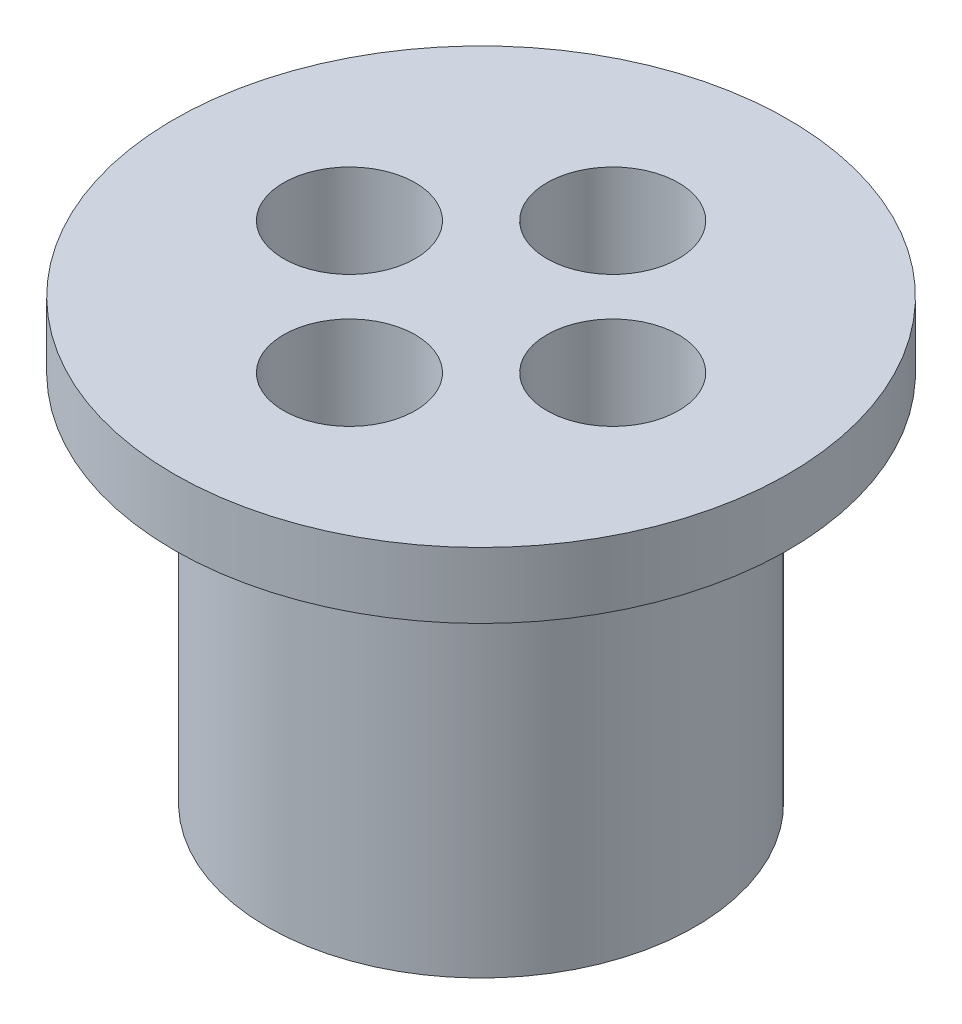
ISO-10303-21;
HEADER;
FILE_DESCRIPTION(('STEP AP214'),'2;1');
FILE_NAME('part.step','',(''),(''),'','','');
FILE_SCHEMA(('AUTOMOTIVE_DESIGN { 1 0 10303 214 1 1 1 1 }'));
ENDSEC;
DATA;
#1=APPLICATION_CONTEXT('core data for automotive mechanical design processes');
#2=APPLICATION_PROTOCOL_DEFINITION('international standard','automotive_design',2000,#1);
#3=PRODUCT_CONTEXT('',#1,'mechanical');
#4=PRODUCT('Part','Part','',(#3));
#5=PRODUCT_RELATED_PRODUCT_CATEGORY('part','',(#4));
#6=PRODUCT_DEFINITION_FORMATION('','',#4);
#7=PRODUCT_DEFINITION_CONTEXT('part definition',#1,'design');
#8=PRODUCT_DEFINITION('design','',#6,#7);
#9=PRODUCT_DEFINITION_SHAPE('','',#8);
#10=(LENGTH_UNIT() NAMED_UNIT(*) SI_UNIT(.MILLI.,.METRE.));
#11=(NAMED_UNIT(*) PLANE_ANGLE_UNIT() SI_UNIT($,.RADIAN.));
#12=(NAMED_UNIT(*) SI_UNIT($,.STERADIAN.) SOLID_ANGLE_UNIT());
#13=UNCERTAINTY_MEASURE_WITH_UNIT(LENGTH_MEASURE(1.E-05),#10,'distance_accuracy_value','');
#14=(GEOMETRIC_REPRESENTATION_CONTEXT(3) GLOBAL_UNCERTAINTY_ASSIGNED_CONTEXT((#13)) GLOBAL_UNIT_ASSIGNED_CONTEXT((#10,
#11,#12)) REPRESENTATION_CONTEXT('',''));
#15=CARTESIAN_POINT('',(0.,0.,0.));
#16=DIRECTION('',(0.,0.,1.));
#17=DIRECTION('',(1.,0.,0.));
#18=AXIS2_PLACEMENT_3D('',#15,#16,#17);
#19=CARTESIAN_POINT('',(0.,20.,6.));
#20=DIRECTION('',(0.,-1.,0.));
#21=DIRECTION('',(0.,0.,-1.));
#22=AXIS2_PLACEMENT_3D('',#19,#20,#21);
#23=CYLINDRICAL_SURFACE('',#22,1.75);
#24=CARTESIAN_POINT('',(0.,0.,6.));
#25=DIRECTION('',(0.,-1.,0.));
#26=DIRECTION('',(0.,0.,-1.));
#27=AXIS2_PLACEMENT_3D('',#24,#25,#26);
#28=CIRCLE('',#27,1.75);
#29=CARTESIAN_POINT('',(0.,0.,4.25));
#30=VERTEX_POINT('',#29);
#31=EDGE_CURVE('E95',#30,#30,#28,.T.);
#32=ORIENTED_EDGE('',*,*,#31,.T.);
#33=EDGE_LOOP('',(#32));
#34=FACE_BOUND('',#33,.T.);
#35=CARTESIAN_POINT('',(0.,10.,6.));
#36=DIRECTION('',(0.,1.,0.));
#37=DIRECTION('',(0.,0.,1.));
#38=AXIS2_PLACEMENT_3D('',#35,#36,#37);
#39=CIRCLE('',#38,1.75);
#40=CARTESIAN_POINT('',(0.,10.,7.75));
#41=VERTEX_POINT('',#40);
#42=EDGE_CURVE('E44',#41,#41,#39,.F.);
#43=ORIENTED_EDGE('',*,*,#42,.F.);
#44=EDGE_LOOP('',(#43));
#45=FACE_BOUND('',#44,.T.);
#46=ADVANCED_FACE('F40',(#34,#45),#23,.F.);
#47=CARTESIAN_POINT('',(-6.,20.,0.));
#48=DIRECTION('',(0.,-1.,0.));
#49=DIRECTION('',(0.,0.,-1.));
#50=AXIS2_PLACEMENT_3D('',#47,#48,#49);
#51=CYLINDRICAL_SURFACE('',#50,1.75);
#52=CARTESIAN_POINT('',(-6.,0.,0.));
#53=DIRECTION('',(0.,-1.,0.));
#54=DIRECTION('',(1.,0.,0.));
#55=AXIS2_PLACEMENT_3D('',#52,#53,#54);
#56=CIRCLE('',#55,1.75);
#57=CARTESIAN_POINT('',(-4.25,0.,0.));
#58=VERTEX_POINT('',#57);
#59=EDGE_CURVE('E65',#58,#58,#56,.T.);
#60=ORIENTED_EDGE('',*,*,#59,.T.);
#61=EDGE_LOOP('',(#60));
#62=FACE_BOUND('',#61,.T.);
#63=CARTESIAN_POINT('',(-6.,10.,0.));
#64=DIRECTION('',(0.,1.,0.));
#65=DIRECTION('',(0.,0.,1.));
#66=AXIS2_PLACEMENT_3D('',#63,#64,#65);
#67=CIRCLE('',#66,1.75);
#68=CARTESIAN_POINT('',(-6.,10.,1.75000000000006));
#69=VERTEX_POINT('',#68);
#70=EDGE_CURVE('E70',#69,#69,#67,.F.);
#71=ORIENTED_EDGE('',*,*,#70,.F.);
#72=EDGE_LOOP('',(#71));
#73=FACE_BOUND('',#72,.T.);
#74=ADVANCED_FACE('F131',(#62,#73),#51,.F.);
#75=CARTESIAN_POINT('',(6.,20.,0.));
#76=DIRECTION('',(0.,-1.,0.));
#77=DIRECTION('',(0.,0.,-1.));
#78=AXIS2_PLACEMENT_3D('',#75,#76,#77);
#79=CYLINDRICAL_SURFACE('',#78,1.75);
#80=CARTESIAN_POINT('',(6.,0.,0.));
#81=DIRECTION('',(0.,-1.,0.));
#82=DIRECTION('',(-1.,0.,0.));
#83=AXIS2_PLACEMENT_3D('',#80,#81,#82);
#84=CIRCLE('',#83,1.75);
#85=CARTESIAN_POINT('',(4.25,0.,0.));
#86=VERTEX_POINT('',#85);
#87=EDGE_CURVE('E91',#86,#86,#84,.T.);
#88=ORIENTED_EDGE('',*,*,#87,.T.);
#89=EDGE_LOOP('',(#88));
#90=FACE_BOUND('',#89,.T.);
#91=CARTESIAN_POINT('',(6.,10.,0.));
#92=DIRECTION('',(0.,1.,0.));
#93=DIRECTION('',(0.,0.,1.));
#94=AXIS2_PLACEMENT_3D('',#91,#92,#93);
#95=CIRCLE('',#94,1.75);
#96=CARTESIAN_POINT('',(6.,10.,1.74999999999998));
#97=VERTEX_POINT('',#96);
#98=EDGE_CURVE('E67',#97,#97,#95,.F.);
#99=ORIENTED_EDGE('',*,*,#98,.F.);
#100=EDGE_LOOP('',(#99));
#101=FACE_BOUND('',#100,.T.);
#102=ADVANCED_FACE('F137',(#90,#101),#79,.F.);
#103=CARTESIAN_POINT('',(0.,20.,-6.));
#104=DIRECTION('',(0.,-1.,0.));
#105=DIRECTION('',(0.,0.,-1.));
#106=AXIS2_PLACEMENT_3D('',#103,#104,#105);
#107=CYLINDRICAL_SURFACE('',#106,1.75);
#108=CARTESIAN_POINT('',(0.,0.,-6.));
#109=DIRECTION('',(0.,-1.,0.));
#110=DIRECTION('',(0.,0.,1.));
#111=AXIS2_PLACEMENT_3D('',#108,#109,#110);
#112=CIRCLE('',#111,1.75);
#113=CARTESIAN_POINT('',(0.,0.,-4.25));
#114=VERTEX_POINT('',#113);
#115=EDGE_CURVE('E96',#114,#114,#112,.T.);
#116=ORIENTED_EDGE('',*,*,#115,.T.);
#117=EDGE_LOOP('',(#116));
#118=FACE_BOUND('',#117,.T.);
#119=CARTESIAN_POINT('',(0.,10.,-6.));
#120=DIRECTION('',(0.,1.,0.));
#121=DIRECTION('',(0.,0.,1.));
#122=AXIS2_PLACEMENT_3D('',#119,#120,#121);
#123=CIRCLE('',#122,1.75);
#124=CARTESIAN_POINT('',(0.,10.,-4.25));
#125=VERTEX_POINT('',#124);
#126=EDGE_CURVE('E61',#125,#125,#123,.F.);
#127=ORIENTED_EDGE('',*,*,#126,.F.);
#128=EDGE_LOOP('',(#127));
#129=FACE_BOUND('',#128,.T.);
#130=ADVANCED_FACE('F142',(#118,#129),#107,.F.);
#131=CARTESIAN_POINT('',(0.,17.,0.));
#132=DIRECTION('',(0.,-1.,0.));
#133=DIRECTION('',(0.,0.,-1.));
#134=AXIS2_PLACEMENT_3D('',#131,#132,#133);
#135=CYLINDRICAL_SURFACE('',#134,9.75);
#136=CARTESIAN_POINT('',(0.,17.,0.));
#137=DIRECTION('',(0.,1.,0.));
#138=DIRECTION('',(0.,0.,1.));
#139=AXIS2_PLACEMENT_3D('',#136,#137,#138);
#140=CIRCLE('',#139,9.75);
#141=CARTESIAN_POINT('',(0.,17.,9.75));
#142=VERTEX_POINT('',#141);
#143=EDGE_CURVE('E10',#142,#142,#140,.T.);
#144=ORIENTED_EDGE('',*,*,#143,.F.);
#145=EDGE_LOOP('',(#144));
#146=FACE_BOUND('',#145,.T.);
#147=CARTESIAN_POINT('',(0.,0.,0.));
#148=DIRECTION('',(0.,1.,0.));
#149=DIRECTION('',(0.,0.,1.));
#150=AXIS2_PLACEMENT_3D('',#147,#148,#149);
#151=CIRCLE('',#150,9.75);
#152=CARTESIAN_POINT('',(0.,0.,9.75));
#153=VERTEX_POINT('',#152);
#154=EDGE_CURVE('E49',#153,#153,#151,.T.);
#155=ORIENTED_EDGE('',*,*,#154,.T.);
#156=EDGE_LOOP('',(#155));
#157=FACE_BOUND('',#156,.T.);
#158=ADVANCED_FACE('F42',(#146,#157),#135,.T.);
#159=CARTESIAN_POINT('',(0.,0.,0.));
#160=DIRECTION('',(0.,1.,0.));
#161=DIRECTION('',(0.,0.,1.));
#162=AXIS2_PLACEMENT_3D('',#159,#160,#161);
#163=PLANE('',#162);
#164=ORIENTED_EDGE('',*,*,#87,.F.);
#165=EDGE_LOOP('',(#164));
#166=FACE_BOUND('',#165,.T.);
#167=ORIENTED_EDGE('',*,*,#115,.F.);
#168=EDGE_LOOP('',(#167));
#169=FACE_BOUND('',#168,.T.);
#170=ORIENTED_EDGE('',*,*,#59,.F.);
#171=EDGE_LOOP('',(#170));
#172=FACE_BOUND('',#171,.T.);
#173=ORIENTED_EDGE('',*,*,#31,.F.);
#174=EDGE_LOOP('',(#173));
#175=FACE_BOUND('',#174,.T.);
#176=ORIENTED_EDGE('',*,*,#154,.F.);
#177=EDGE_LOOP('',(#176));
#178=FACE_BOUND('',#177,.T.);
#179=ADVANCED_FACE('F319',(#166,#169,#172,#175,#178),#163,.F.);
#180=CARTESIAN_POINT('',(0.,20.,0.));
#181=DIRECTION('',(0.,-1.,0.));
#182=DIRECTION('',(0.,0.,-1.));
#183=AXIS2_PLACEMENT_3D('',#180,#181,#182);
#184=CYLINDRICAL_SURFACE('',#183,14.);
#185=CARTESIAN_POINT('',(0.,20.,0.));
#186=DIRECTION('',(0.,1.,0.));
#187=DIRECTION('',(0.,0.,1.));
#188=AXIS2_PLACEMENT_3D('',#185,#186,#187);
#189=CIRCLE('',#188,14.);
#190=CARTESIAN_POINT('',(0.,20.,14.));
#191=VERTEX_POINT('',#190);
#192=EDGE_CURVE('E55',#191,#191,#189,.T.);
#193=ORIENTED_EDGE('',*,*,#192,.F.);
#194=EDGE_LOOP('',(#193));
#195=FACE_BOUND('',#194,.T.);
#196=CARTESIAN_POINT('',(0.,17.,0.));
#197=DIRECTION('',(0.,1.,0.));
#198=DIRECTION('',(0.,0.,1.));
#199=AXIS2_PLACEMENT_3D('',#196,#197,#198);
#200=CIRCLE('',#199,14.);
#201=CARTESIAN_POINT('',(0.,17.,14.));
#202=VERTEX_POINT('',#201);
#203=EDGE_CURVE('E58',#202,#202,#200,.T.);
#204=ORIENTED_EDGE('',*,*,#203,.T.);
#205=EDGE_LOOP('',(#204));
#206=FACE_BOUND('',#205,.T.);
#207=ADVANCED_FACE('F113',(#195,#206),#184,.T.);
#208=CARTESIAN_POINT('',(0.,20.,0.));
#209=DIRECTION('',(0.,1.,0.));
#210=DIRECTION('',(0.,0.,1.));
#211=AXIS2_PLACEMENT_3D('',#208,#209,#210);
#212=PLANE('',#211);
#213=CARTESIAN_POINT('',(0.,20.,6.));
#214=DIRECTION('',(0.,1.,0.));
#215=DIRECTION('',(0.,0.,-1.));
#216=AXIS2_PLACEMENT_3D('',#213,#214,#215);
#217=CIRCLE('',#216,3.);
#218=CARTESIAN_POINT('',(0.,20.,3.));
#219=VERTEX_POINT('',#218);
#220=EDGE_CURVE('E184',#219,#219,#217,.T.);
#221=ORIENTED_EDGE('',*,*,#220,.F.);
#222=EDGE_LOOP('',(#221));
#223=FACE_BOUND('',#222,.T.);
#224=CARTESIAN_POINT('',(6.,20.,0.));
#225=DIRECTION('',(0.,1.,0.));
#226=DIRECTION('',(-1.,0.,0.));
#227=AXIS2_PLACEMENT_3D('',#224,#225,#226);
#228=CIRCLE('',#227,3.);
#229=CARTESIAN_POINT('',(3.,20.,0.));
#230=VERTEX_POINT('',#229);
#231=EDGE_CURVE('E185',#230,#230,#228,.T.);
#232=ORIENTED_EDGE('',*,*,#231,.F.);
#233=EDGE_LOOP('',(#232));
#234=FACE_BOUND('',#233,.T.);
#235=CARTESIAN_POINT('',(-6.,20.,0.));
#236=DIRECTION('',(0.,1.,0.));
#237=DIRECTION('',(1.,0.,0.));
#238=AXIS2_PLACEMENT_3D('',#235,#236,#237);
#239=CIRCLE('',#238,3.);
#240=CARTESIAN_POINT('',(-3.,20.,0.));
#241=VERTEX_POINT('',#240);
#242=EDGE_CURVE('E197',#241,#241,#239,.T.);
#243=ORIENTED_EDGE('',*,*,#242,.F.);
#244=EDGE_LOOP('',(#243));
#245=FACE_BOUND('',#244,.T.);
#246=CARTESIAN_POINT('',(0.,20.,-6.));
#247=DIRECTION('',(0.,1.,0.));
#248=DIRECTION('',(0.,0.,1.));
#249=AXIS2_PLACEMENT_3D('',#246,#247,#248);
#250=CIRCLE('',#249,3.);
#251=CARTESIAN_POINT('',(0.,20.,-3.));
#252=VERTEX_POINT('',#251);
#253=EDGE_CURVE('E78',#252,#252,#250,.T.);
#254=ORIENTED_EDGE('',*,*,#253,.F.);
#255=EDGE_LOOP('',(#254));
#256=FACE_BOUND('',#255,.T.);
#257=ORIENTED_EDGE('',*,*,#192,.T.);
#258=EDGE_LOOP('',(#257));
#259=FACE_BOUND('',#258,.T.);
#260=ADVANCED_FACE('F118',(#223,#234,#245,#256,#259),#212,.T.);
#261=CARTESIAN_POINT('',(0.,17.,0.));
#262=DIRECTION('',(0.,1.,0.));
#263=DIRECTION('',(0.,0.,1.));
#264=AXIS2_PLACEMENT_3D('',#261,#262,#263);
#265=PLANE('',#264);
#266=ORIENTED_EDGE('',*,*,#143,.T.);
#267=EDGE_LOOP('',(#266));
#268=FACE_BOUND('',#267,.T.);
#269=ORIENTED_EDGE('',*,*,#203,.F.);
#270=EDGE_LOOP('',(#269));
#271=FACE_BOUND('',#270,.T.);
#272=ADVANCED_FACE('F115',(#268,#271),#265,.F.);
#273=CARTESIAN_POINT('',(0.,10.,-6.));
#274=DIRECTION('',(0.,1.,0.));
#275=DIRECTION('',(0.,0.,1.));
#276=AXIS2_PLACEMENT_3D('',#273,#274,#275);
#277=PLANE('',#276);
#278=CARTESIAN_POINT('',(0.,10.,-6.));
#279=DIRECTION('',(0.,1.,0.));
#280=DIRECTION('',(0.,0.,1.));
#281=AXIS2_PLACEMENT_3D('',#278,#279,#280);
#282=CIRCLE('',#281,3.);
#283=CARTESIAN_POINT('',(0.,10.,-3.));
#284=VERTEX_POINT('',#283);
#285=EDGE_CURVE('E66',#284,#284,#282,.T.);
#286=ORIENTED_EDGE('',*,*,#285,.T.);
#287=EDGE_LOOP('',(#286));
#288=FACE_BOUND('',#287,.T.);
#289=ORIENTED_EDGE('',*,*,#126,.T.);
#290=EDGE_LOOP('',(#289));
#291=FACE_BOUND('',#290,.T.);
#292=ADVANCED_FACE('F117',(#288,#291),#277,.T.);
#293=CARTESIAN_POINT('',(0.,10.,-6.));
#294=DIRECTION('',(0.,1.,0.));
#295=DIRECTION('',(0.,0.,1.));
#296=AXIS2_PLACEMENT_3D('',#293,#294,#295);
#297=CYLINDRICAL_SURFACE('',#296,3.);
#298=ORIENTED_EDGE('',*,*,#285,.F.);
#299=EDGE_LOOP('',(#298));
#300=FACE_BOUND('',#299,.T.);
#301=ORIENTED_EDGE('',*,*,#253,.T.);
#302=EDGE_LOOP('',(#301));
#303=FACE_BOUND('',#302,.T.);
#304=ADVANCED_FACE('F124',(#300,#303),#297,.F.);
#305=CARTESIAN_POINT('',(6.,10.,0.));
#306=DIRECTION('',(0.,1.,0.));
#307=DIRECTION('',(-1.,0.,0.));
#308=AXIS2_PLACEMENT_3D('',#305,#306,#307);
#309=PLANE('',#308);
#310=CARTESIAN_POINT('',(6.,10.,0.));
#311=DIRECTION('',(0.,1.,0.));
#312=DIRECTION('',(-1.,0.,0.));
#313=AXIS2_PLACEMENT_3D('',#310,#311,#312);
#314=CIRCLE('',#313,3.);
#315=CARTESIAN_POINT('',(3.,10.,0.));
#316=VERTEX_POINT('',#315);
#317=EDGE_CURVE('E180',#316,#316,#314,.T.);
#318=ORIENTED_EDGE('',*,*,#317,.T.);
#319=EDGE_LOOP('',(#318));
#320=FACE_BOUND('',#319,.T.);
#321=ORIENTED_EDGE('',*,*,#98,.T.);
#322=EDGE_LOOP('',(#321));
#323=FACE_BOUND('',#322,.T.);
#324=ADVANCED_FACE('F150',(#320,#323),#309,.T.);
#325=CARTESIAN_POINT('',(6.,10.,0.));
#326=DIRECTION('',(0.,1.,0.));
#327=DIRECTION('',(0.,0.,1.));
#328=AXIS2_PLACEMENT_3D('',#325,#326,#327);
#329=CYLINDRICAL_SURFACE('',#328,3.);
#330=ORIENTED_EDGE('',*,*,#317,.F.);
#331=EDGE_LOOP('',(#330));
#332=FACE_BOUND('',#331,.T.);
#333=ORIENTED_EDGE('',*,*,#231,.T.);
#334=EDGE_LOOP('',(#333));
#335=FACE_BOUND('',#334,.T.);
#336=ADVANCED_FACE('F161',(#332,#335),#329,.F.);
#337=CARTESIAN_POINT('',(-6.,10.,0.));
#338=DIRECTION('',(0.,1.,0.));
#339=DIRECTION('',(1.,0.,0.));
#340=AXIS2_PLACEMENT_3D('',#337,#338,#339);
#341=PLANE('',#340);
#342=CARTESIAN_POINT('',(-6.,10.,0.));
#343=DIRECTION('',(0.,1.,0.));
#344=DIRECTION('',(1.,0.,0.));
#345=AXIS2_PLACEMENT_3D('',#342,#343,#344);
#346=CIRCLE('',#345,3.);
#347=CARTESIAN_POINT('',(-3.,10.,0.));
#348=VERTEX_POINT('',#347);
#349=EDGE_CURVE('E71',#348,#348,#346,.T.);
#350=ORIENTED_EDGE('',*,*,#349,.T.);
#351=EDGE_LOOP('',(#350));
#352=FACE_BOUND('',#351,.T.);
#353=ORIENTED_EDGE('',*,*,#70,.T.);
#354=EDGE_LOOP('',(#353));
#355=FACE_BOUND('',#354,.T.);
#356=ADVANCED_FACE('F157',(#352,#355),#341,.T.);
#357=CARTESIAN_POINT('',(-6.,10.,0.));
#358=DIRECTION('',(0.,1.,0.));
#359=DIRECTION('',(0.,0.,1.));
#360=AXIS2_PLACEMENT_3D('',#357,#358,#359);
#361=CYLINDRICAL_SURFACE('',#360,3.);
#362=ORIENTED_EDGE('',*,*,#349,.F.);
#363=EDGE_LOOP('',(#362));
#364=FACE_BOUND('',#363,.T.);
#365=ORIENTED_EDGE('',*,*,#242,.T.);
#366=EDGE_LOOP('',(#365));
#367=FACE_BOUND('',#366,.T.);
#368=ADVANCED_FACE('F153',(#364,#367),#361,.F.);
#369=CARTESIAN_POINT('',(0.,10.,6.));
#370=DIRECTION('',(0.,1.,0.));
#371=DIRECTION('',(0.,0.,-1.));
#372=AXIS2_PLACEMENT_3D('',#369,#370,#371);
#373=PLANE('',#372);
#374=CARTESIAN_POINT('',(0.,10.,6.));
#375=DIRECTION('',(0.,1.,0.));
#376=DIRECTION('',(0.,0.,-1.));
#377=AXIS2_PLACEMENT_3D('',#374,#375,#376);
#378=CIRCLE('',#377,3.);
#379=CARTESIAN_POINT('',(0.,10.,3.));
#380=VERTEX_POINT('',#379);
#381=EDGE_CURVE('E190',#380,#380,#378,.T.);
#382=ORIENTED_EDGE('',*,*,#381,.T.);
#383=EDGE_LOOP('',(#382));
#384=FACE_BOUND('',#383,.T.);
#385=ORIENTED_EDGE('',*,*,#42,.T.);
#386=EDGE_LOOP('',(#385));
#387=FACE_BOUND('',#386,.T.);
#388=ADVANCED_FACE('F156',(#384,#387),#373,.T.);
#389=CARTESIAN_POINT('',(0.,10.,6.));
#390=DIRECTION('',(0.,1.,0.));
#391=DIRECTION('',(0.,0.,1.));
#392=AXIS2_PLACEMENT_3D('',#389,#390,#391);
#393=CYLINDRICAL_SURFACE('',#392,3.);
#394=ORIENTED_EDGE('',*,*,#381,.F.);
#395=EDGE_LOOP('',(#394));
#396=FACE_BOUND('',#395,.T.);
#397=ORIENTED_EDGE('',*,*,#220,.T.);
#398=EDGE_LOOP('',(#397));
#399=FACE_BOUND('',#398,.T.);
#400=ADVANCED_FACE('F163',(#396,#399),#393,.F.);
#401=CLOSED_SHELL('',(#46,#74,#102,#130,#158,#179,#207,#260,#272,#292,#304,#324,#336,#356,#368,
#388,#400));
#402=MANIFOLD_SOLID_BREP('B2',#401);
#403=ADVANCED_BREP_SHAPE_REPRESENTATION('',(#18,#402),#14);
#404=SHAPE_DEFINITION_REPRESENTATION(#9,#403);
ENDSEC;
END-ISO-10303-21;
